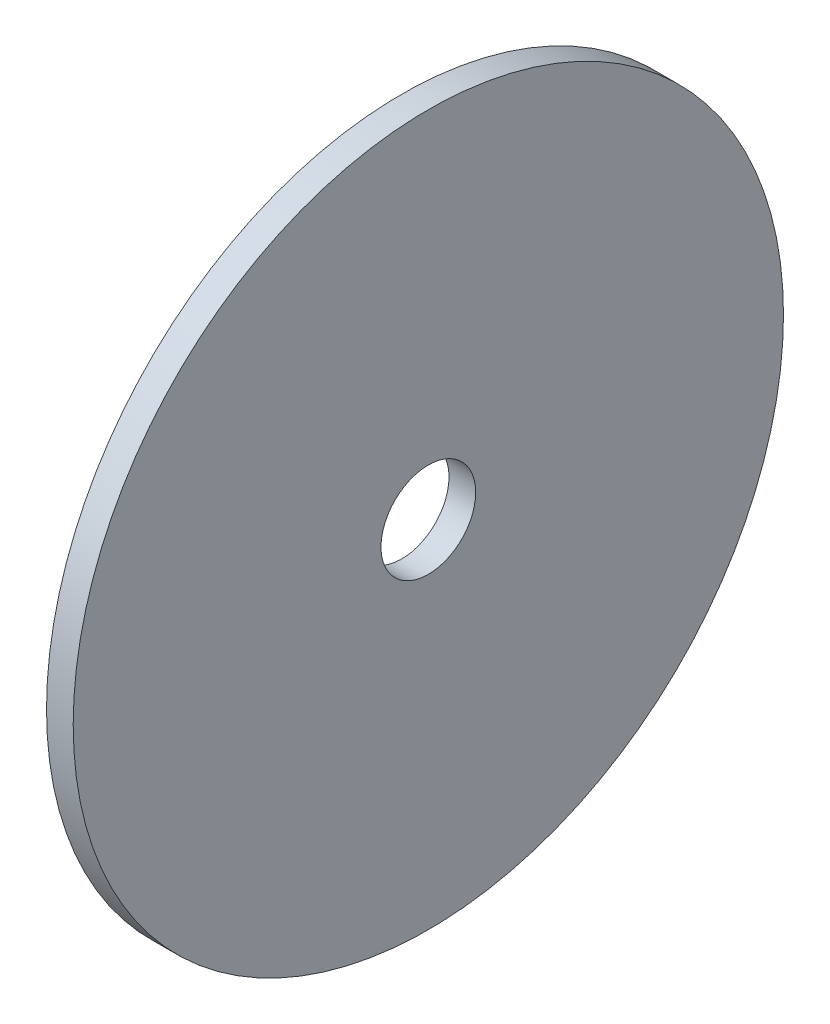
ISO-10303-21;
HEADER;
FILE_DESCRIPTION(('STEP AP214'),'2;1');
FILE_NAME('part.step','',(''),(''),'','','');
FILE_SCHEMA(('AUTOMOTIVE_DESIGN { 1 0 10303 214 1 1 1 1 }'));
ENDSEC;
DATA;
#1=APPLICATION_CONTEXT('core data for automotive mechanical design processes');
#2=APPLICATION_PROTOCOL_DEFINITION('international standard','automotive_design',2000,#1);
#3=PRODUCT_CONTEXT('',#1,'mechanical');
#4=PRODUCT('Part','Part','',(#3));
#5=PRODUCT_RELATED_PRODUCT_CATEGORY('part','',(#4));
#6=PRODUCT_DEFINITION_FORMATION('','',#4);
#7=PRODUCT_DEFINITION_CONTEXT('part definition',#1,'design');
#8=PRODUCT_DEFINITION('design','',#6,#7);
#9=PRODUCT_DEFINITION_SHAPE('','',#8);
#10=(LENGTH_UNIT() NAMED_UNIT(*) SI_UNIT(.MILLI.,.METRE.));
#11=(NAMED_UNIT(*) PLANE_ANGLE_UNIT() SI_UNIT($,.RADIAN.));
#12=(NAMED_UNIT(*) SI_UNIT($,.STERADIAN.) SOLID_ANGLE_UNIT());
#13=UNCERTAINTY_MEASURE_WITH_UNIT(LENGTH_MEASURE(1.E-05),#10,'distance_accuracy_value','');
#14=(GEOMETRIC_REPRESENTATION_CONTEXT(3) GLOBAL_UNCERTAINTY_ASSIGNED_CONTEXT((#13)) GLOBAL_UNIT_ASSIGNED_CONTEXT((#10,
#11,#12)) REPRESENTATION_CONTEXT('',''));
#15=CARTESIAN_POINT('',(0.,0.,0.));
#16=DIRECTION('',(0.,0.,1.));
#17=DIRECTION('',(1.,0.,0.));
#18=AXIS2_PLACEMENT_3D('',#15,#16,#17);
#19=CARTESIAN_POINT('',(100.,0.,0.));
#20=DIRECTION('',(1.,0.,0.));
#21=DIRECTION('',(0.,0.,-1.));
#22=AXIS2_PLACEMENT_3D('',#19,#20,#21);
#23=PLANE('',#22);
#24=CARTESIAN_POINT('',(100.,0.,0.));
#25=DIRECTION('',(1.,0.,0.));
#26=DIRECTION('',(0.,0.,-1.));
#27=AXIS2_PLACEMENT_3D('',#24,#25,#26);
#28=CIRCLE('',#27,53.25);
#29=CARTESIAN_POINT('',(100.,0.,-53.25));
#30=VERTEX_POINT('',#29);
#31=EDGE_CURVE('E10',#30,#30,#28,.T.);
#32=ORIENTED_EDGE('',*,*,#31,.T.);
#33=EDGE_LOOP('',(#32));
#34=FACE_BOUND('',#33,.T.);
#35=CARTESIAN_POINT('',(100.,0.,0.));
#36=DIRECTION('',(1.,0.,0.));
#37=DIRECTION('',(0.,0.,-1.));
#38=AXIS2_PLACEMENT_3D('',#35,#36,#37);
#39=CIRCLE('',#38,7.1);
#40=CARTESIAN_POINT('',(100.,0.,-7.1));
#41=VERTEX_POINT('',#40);
#42=EDGE_CURVE('E43',#41,#41,#39,.T.);
#43=ORIENTED_EDGE('',*,*,#42,.F.);
#44=EDGE_LOOP('',(#43));
#45=FACE_BOUND('',#44,.T.);
#46=ADVANCED_FACE('F32',(#34,#45),#23,.T.);
#47=CARTESIAN_POINT('',(96.,0.,0.));
#48=DIRECTION('',(1.,0.,0.));
#49=DIRECTION('',(0.,0.,-1.));
#50=AXIS2_PLACEMENT_3D('',#47,#48,#49);
#51=PLANE('',#50);
#52=CARTESIAN_POINT('',(96.,0.,0.));
#53=DIRECTION('',(1.,0.,0.));
#54=DIRECTION('',(0.,0.,-1.));
#55=AXIS2_PLACEMENT_3D('',#52,#53,#54);
#56=CIRCLE('',#55,53.25);
#57=CARTESIAN_POINT('',(96.,0.,-53.25));
#58=VERTEX_POINT('',#57);
#59=EDGE_CURVE('E36',#58,#58,#56,.T.);
#60=ORIENTED_EDGE('',*,*,#59,.F.);
#61=EDGE_LOOP('',(#60));
#62=FACE_BOUND('',#61,.T.);
#63=CARTESIAN_POINT('',(96.,0.,0.));
#64=DIRECTION('',(1.,0.,0.));
#65=DIRECTION('',(0.,0.,-1.));
#66=AXIS2_PLACEMENT_3D('',#63,#64,#65);
#67=CIRCLE('',#66,7.1);
#68=CARTESIAN_POINT('',(96.,0.,-7.1));
#69=VERTEX_POINT('',#68);
#70=EDGE_CURVE('E45',#69,#69,#67,.T.);
#71=ORIENTED_EDGE('',*,*,#70,.T.);
#72=EDGE_LOOP('',(#71));
#73=FACE_BOUND('',#72,.T.);
#74=ADVANCED_FACE('F55',(#62,#73),#51,.F.);
#75=CARTESIAN_POINT('',(100.,0.,0.));
#76=DIRECTION('',(-1.,0.,0.));
#77=DIRECTION('',(0.,0.,1.));
#78=AXIS2_PLACEMENT_3D('',#75,#76,#77);
#79=CYLINDRICAL_SURFACE('',#78,53.25);
#80=ORIENTED_EDGE('',*,*,#31,.F.);
#81=EDGE_LOOP('',(#80));
#82=FACE_BOUND('',#81,.T.);
#83=ORIENTED_EDGE('',*,*,#59,.T.);
#84=EDGE_LOOP('',(#83));
#85=FACE_BOUND('',#84,.T.);
#86=ADVANCED_FACE('F34',(#82,#85),#79,.T.);
#87=CARTESIAN_POINT('',(100.,0.,0.));
#88=DIRECTION('',(-1.,0.,0.));
#89=DIRECTION('',(0.,0.,1.));
#90=AXIS2_PLACEMENT_3D('',#87,#88,#89);
#91=CYLINDRICAL_SURFACE('',#90,7.1);
#92=ORIENTED_EDGE('',*,*,#42,.T.);
#93=EDGE_LOOP('',(#92));
#94=FACE_BOUND('',#93,.T.);
#95=ORIENTED_EDGE('',*,*,#70,.F.);
#96=EDGE_LOOP('',(#95));
#97=FACE_BOUND('',#96,.T.);
#98=ADVANCED_FACE('F51',(#94,#97),#91,.F.);
#99=CLOSED_SHELL('',(#46,#74,#86,#98));
#100=MANIFOLD_SOLID_BREP('B2',#99);
#101=ADVANCED_BREP_SHAPE_REPRESENTATION('',(#18,#100),#14);
#102=SHAPE_DEFINITION_REPRESENTATION(#9,#101);
ENDSEC;
END-ISO-10303-21;
